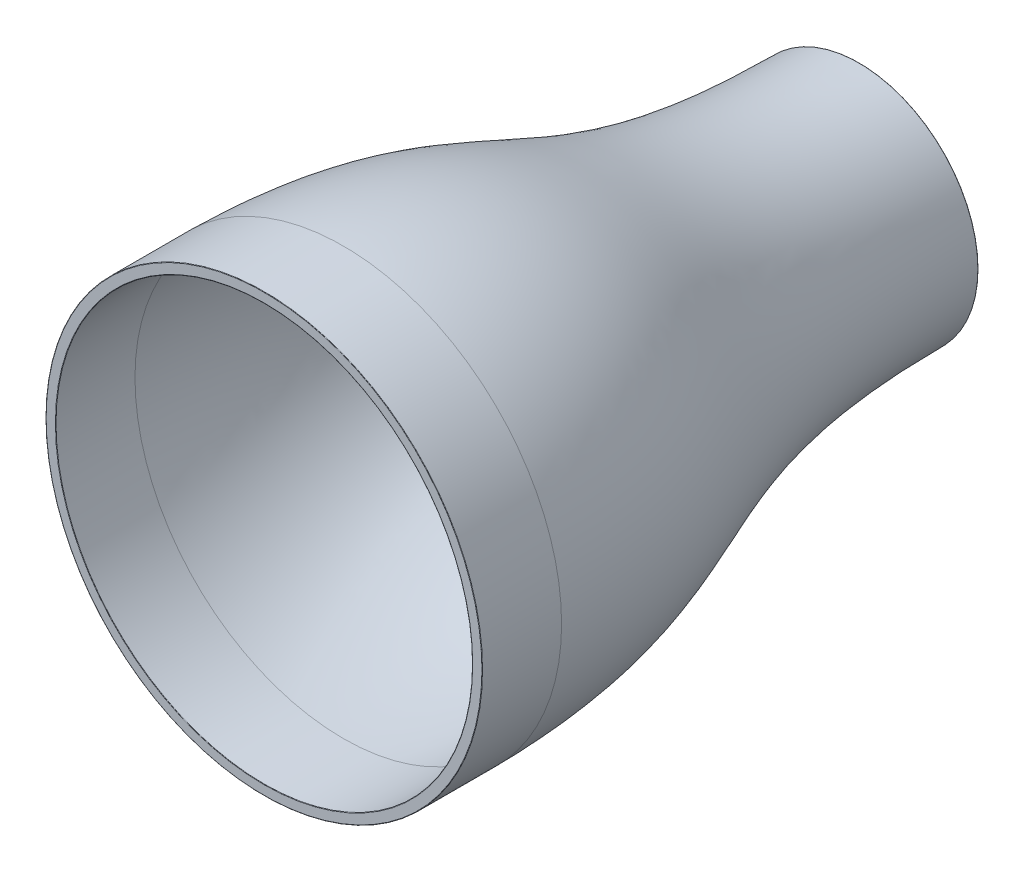
ISO-10303-21;
HEADER;
FILE_DESCRIPTION(('STEP AP214'),'2;1');
FILE_NAME('part.step','',(''),(''),'','','');
FILE_SCHEMA(('AUTOMOTIVE_DESIGN { 1 0 10303 214 1 1 1 1 }'));
ENDSEC;
DATA;
#1=APPLICATION_CONTEXT('core data for automotive mechanical design processes');
#2=APPLICATION_PROTOCOL_DEFINITION('international standard','automotive_design',2000,#1);
#3=PRODUCT_CONTEXT('',#1,'mechanical');
#4=PRODUCT('Part','Part','',(#3));
#5=PRODUCT_RELATED_PRODUCT_CATEGORY('part','',(#4));
#6=PRODUCT_DEFINITION_FORMATION('','',#4);
#7=PRODUCT_DEFINITION_CONTEXT('part definition',#1,'design');
#8=PRODUCT_DEFINITION('design','',#6,#7);
#9=PRODUCT_DEFINITION_SHAPE('','',#8);
#10=(LENGTH_UNIT() NAMED_UNIT(*) SI_UNIT(.MILLI.,.METRE.));
#11=(NAMED_UNIT(*) PLANE_ANGLE_UNIT() SI_UNIT($,.RADIAN.));
#12=(NAMED_UNIT(*) SI_UNIT($,.STERADIAN.) SOLID_ANGLE_UNIT());
#13=UNCERTAINTY_MEASURE_WITH_UNIT(LENGTH_MEASURE(1.E-05),#10,'distance_accuracy_value','');
#14=(GEOMETRIC_REPRESENTATION_CONTEXT(3) GLOBAL_UNCERTAINTY_ASSIGNED_CONTEXT((#13)) GLOBAL_UNIT_ASSIGNED_CONTEXT((#10,
#11,#12)) REPRESENTATION_CONTEXT('',''));
#15=CARTESIAN_POINT('',(0.,0.,0.));
#16=DIRECTION('',(0.,0.,1.));
#17=DIRECTION('',(1.,0.,0.));
#18=AXIS2_PLACEMENT_3D('',#15,#16,#17);
#19=CARTESIAN_POINT('',(0.,105.000572400585,-39.9243450054198));
#20=CARTESIAN_POINT('',(0.,104.985737614351,-40.9046562213823));
#21=CARTESIAN_POINT('',(0.,104.950071243296,-42.8773000139634));
#22=CARTESIAN_POINT('',(0.,104.857338815363,-46.7252645867954));
#23=CARTESIAN_POINT('',(0.,104.700972371027,-51.4222905703763));
#24=CARTESIAN_POINT('',(0.,104.451154587629,-56.8635526672507));
#25=CARTESIAN_POINT('',(0.,104.038009353299,-63.8748037993634));
#26=CARTESIAN_POINT('',(0.,103.37708158559,-72.195159933021));
#27=CARTESIAN_POINT('',(0.,102.370461384114,-81.5249276309053));
#28=CARTESIAN_POINT('',(0.,101.167896472152,-90.2544638520136));
#29=CARTESIAN_POINT('',(0.,99.3262296102299,-101.167419573885));
#30=CARTESIAN_POINT('',(0.,96.6200165044764,-113.586002401627));
#31=CARTESIAN_POINT('',(0.,92.8556752147571,-126.985333475729));
#32=CARTESIAN_POINT('',(0.,88.6957204964014,-139.338719286288));
#33=CARTESIAN_POINT('',(0.,84.257785223071,-151.098628177712));
#34=CARTESIAN_POINT('',(0.,79.6644870089264,-162.706347452458));
#35=CARTESIAN_POINT('',(0.,75.0508323505693,-174.588858931834));
#36=CARTESIAN_POINT('',(0.,70.5652691844925,-187.158880914814));
#37=CARTESIAN_POINT('',(0.,66.3638715469991,-200.81749241288));
#38=CARTESIAN_POINT('',(0.,62.6017423226897,-215.959791253005));
#39=CARTESIAN_POINT('',(0.,59.9562523428313,-230.145053895562));
#40=CARTESIAN_POINT('',(0.,58.2038775868452,-242.635081409947));
#41=CARTESIAN_POINT('',(0.,57.0885892459282,-252.624857821474));
#42=CARTESIAN_POINT('',(0.,56.1891603960676,-263.288718977623));
#43=CARTESIAN_POINT('',(0.,55.6334432269094,-272.780286443282));
#44=CARTESIAN_POINT('',(0.,55.3134825704408,-280.763464410638));
#45=CARTESIAN_POINT('',(0.,55.1379006859554,-286.950915001881));
#46=CARTESIAN_POINT('',(0.,55.0469708048572,-292.284489738278));
#47=CARTESIAN_POINT('',(0.,55.0085109132386,-296.649552564194));
#48=CARTESIAN_POINT('',(0.,55.0008675261206,-298.884988736389));
#49=CARTESIAN_POINT('',(0.,55.0000015186777,-299.996102978673));
#50=B_SPLINE_CURVE_WITH_KNOTS('',3,(#19,#20,#21,#22,#23,#24,#25,#26,#27,#28,#29,#30,#31,#32,#33,
#34,#35,#36,#37,#38,#39,#40,#41,#42,#43,#44,#45,#46,#47,#48,#49),.UNSPECIFIED.,.F.,.F.,(4,1,1,1,
1,1,1,1,1,1,1,1,1,1,1,1,1,1,1,1,1,1,1,1,1,1,1,1,4),(0.,0.0078125,0.015625,0.03125,0.046875,
0.0625,0.09375,0.125,0.15625,0.1875,0.25,0.3125,0.375,0.4375,0.5,0.5625,0.625,0.6875,0.75,
0.8125,0.84375,0.875,0.90625,0.9375,0.953125,0.96875,0.984375,0.9921875,1.),.UNSPECIFIED.);
#51=CARTESIAN_POINT('',(0.,0.,0.));
#52=DIRECTION('',(0.,0.,1.));
#53=AXIS1_PLACEMENT('',#51,#52);
#54=SURFACE_OF_REVOLUTION('',#50,#53);
#55=CARTESIAN_POINT('',(0.,0.,-270.));
#56=DIRECTION('',(0.,0.,1.));
#57=DIRECTION('',(1.,0.,0.));
#58=AXIS2_PLACEMENT_3D('',#55,#56,#57);
#59=CIRCLE('',#58,55.8093728484014);
#60=CARTESIAN_POINT('',(55.8093728484014,0.,-270.));
#61=VERTEX_POINT('',#60);
#62=EDGE_CURVE('E64',#61,#61,#59,.T.);
#63=ORIENTED_EDGE('',*,*,#62,.F.);
#64=EDGE_LOOP('',(#63));
#65=FACE_BOUND('',#64,.T.);
#66=CARTESIAN_POINT('',(0.,0.,-39.9620754887576));
#67=DIRECTION('',(0.,0.,1.));
#68=DIRECTION('',(1.,0.,0.));
#69=AXIS2_PLACEMENT_3D('',#66,#67,#68);
#70=CIRCLE('',#69,105.);
#71=CARTESIAN_POINT('',(105.,0.,-39.9620754887576));
#72=VERTEX_POINT('',#71);
#73=EDGE_CURVE('E70',#72,#72,#70,.T.);
#74=ORIENTED_EDGE('',*,*,#73,.T.);
#75=EDGE_LOOP('',(#74));
#76=FACE_BOUND('',#75,.T.);
#77=ADVANCED_FACE('F32',(#65,#76),#54,.T.);
#78=CARTESIAN_POINT('',(0.,67.4369789211045,-270.));
#79=DIRECTION('',(0.,0.,-1.));
#80=DIRECTION('',(-1.,0.,0.));
#81=AXIS2_PLACEMENT_3D('',#78,#79,#80);
#82=PLANE('',#81);
#83=CARTESIAN_POINT('',(0.,0.,-270.));
#84=DIRECTION('',(0.,0.,-1.));
#85=DIRECTION('',(-1.,0.,0.));
#86=AXIS2_PLACEMENT_3D('',#83,#84,#85);
#87=CIRCLE('',#86,55.);
#88=CARTESIAN_POINT('',(-55.,0.,-270.));
#89=VERTEX_POINT('',#88);
#90=EDGE_CURVE('E73',#89,#89,#87,.T.);
#91=ORIENTED_EDGE('',*,*,#90,.T.);
#92=EDGE_LOOP('',(#91));
#93=FACE_BOUND('',#92,.T.);
#94=ORIENTED_EDGE('',*,*,#62,.T.);
#95=EDGE_LOOP('',(#94));
#96=FACE_BOUND('',#95,.T.);
#97=ADVANCED_FACE('F96',(#93,#96),#82,.F.);
#98=CARTESIAN_POINT('',(0.,67.4369789211045,-300.));
#99=DIRECTION('',(0.,0.,1.));
#100=DIRECTION('',(1.,0.,0.));
#101=AXIS2_PLACEMENT_3D('',#98,#99,#100);
#102=PLANE('',#101);
#103=CARTESIAN_POINT('',(0.,0.,-300.));
#104=DIRECTION('',(0.,0.,1.));
#105=DIRECTION('',(1.,0.,0.));
#106=AXIS2_PLACEMENT_3D('',#103,#104,#105);
#107=CIRCLE('',#106,59.8001873768291);
#108=CARTESIAN_POINT('',(59.8001873768291,0.,-300.));
#109=VERTEX_POINT('',#108);
#110=EDGE_CURVE('E55',#109,#109,#107,.F.);
#111=ORIENTED_EDGE('',*,*,#110,.T.);
#112=EDGE_LOOP('',(#111));
#113=FACE_BOUND('',#112,.T.);
#114=CARTESIAN_POINT('',(0.,0.,-300.));
#115=DIRECTION('',(0.,0.,1.));
#116=DIRECTION('',(1.,0.,0.));
#117=AXIS2_PLACEMENT_3D('',#114,#115,#116);
#118=CIRCLE('',#117,55.2);
#119=CARTESIAN_POINT('',(55.2,0.,-300.));
#120=VERTEX_POINT('',#119);
#121=EDGE_CURVE('E58',#120,#120,#118,.T.);
#122=ORIENTED_EDGE('',*,*,#121,.T.);
#123=EDGE_LOOP('',(#122));
#124=FACE_BOUND('',#123,.T.);
#125=ADVANCED_FACE('F91',(#113,#124),#102,.F.);
#126=CARTESIAN_POINT('',(0.,110.,-40.));
#127=CARTESIAN_POINT('',(0.,108.065881673556,-167.810260187202));
#128=CARTESIAN_POINT('',(0.,60.1108876472334,-157.727730686123));
#129=CARTESIAN_POINT('',(0.,60.,-300.));
#130=B_SPLINE_CURVE_WITH_KNOTS('',3,(#126,#127,#128,#129),.UNSPECIFIED.,.F.,.F.,(4,4),(0.,1.),.UNSPECIFIED.);
#131=CARTESIAN_POINT('',(0.,0.,0.));
#132=DIRECTION('',(0.,0.,1.));
#133=AXIS1_PLACEMENT('',#131,#132);
#134=SURFACE_OF_REVOLUTION('',#130,#133);
#135=CARTESIAN_POINT('',(0.,0.,-299.800219065352));
#136=DIRECTION('',(0.,0.,1.));
#137=DIRECTION('',(1.,0.,0.));
#138=AXIS2_PLACEMENT_3D('',#135,#136,#137);
#139=CIRCLE('',#138,60.000187256855);
#140=CARTESIAN_POINT('',(60.000187256855,0.,-299.800219065352));
#141=VERTEX_POINT('',#140);
#142=EDGE_CURVE('E61',#141,#141,#139,.T.);
#143=ORIENTED_EDGE('',*,*,#142,.T.);
#144=EDGE_LOOP('',(#143));
#145=FACE_BOUND('',#144,.T.);
#146=CARTESIAN_POINT('',(0.,0.,-40.));
#147=DIRECTION('',(0.,0.,1.));
#148=DIRECTION('',(1.,0.,0.));
#149=AXIS2_PLACEMENT_3D('',#146,#147,#148);
#150=CIRCLE('',#149,110.);
#151=CARTESIAN_POINT('',(110.,0.,-40.));
#152=VERTEX_POINT('',#151);
#153=EDGE_CURVE('E67',#152,#152,#150,.T.);
#154=ORIENTED_EDGE('',*,*,#153,.F.);
#155=EDGE_LOOP('',(#154));
#156=FACE_BOUND('',#155,.T.);
#157=ADVANCED_FACE('F86',(#145,#156),#134,.F.);
#158=CARTESIAN_POINT('',(0.,0.,0.));
#159=DIRECTION('',(0.,0.,1.));
#160=DIRECTION('',(1.,0.,0.));
#161=AXIS2_PLACEMENT_3D('',#158,#159,#160);
#162=CYLINDRICAL_SURFACE('',#161,110.);
#163=CARTESIAN_POINT('',(0.,0.,-0.2));
#164=DIRECTION('',(0.,0.,1.));
#165=DIRECTION('',(1.,0.,0.));
#166=AXIS2_PLACEMENT_3D('',#163,#164,#165);
#167=CIRCLE('',#166,110.);
#168=CARTESIAN_POINT('',(110.,0.,-0.2));
#169=VERTEX_POINT('',#168);
#170=EDGE_CURVE('E10',#169,#169,#167,.F.);
#171=ORIENTED_EDGE('',*,*,#170,.T.);
#172=EDGE_LOOP('',(#171));
#173=FACE_BOUND('',#172,.T.);
#174=ORIENTED_EDGE('',*,*,#153,.T.);
#175=EDGE_LOOP('',(#174));
#176=FACE_BOUND('',#175,.T.);
#177=ADVANCED_FACE('F90',(#173,#176),#162,.T.);
#178=CARTESIAN_POINT('',(0.,67.4369789211045,0.));
#179=DIRECTION('',(0.,0.,1.));
#180=DIRECTION('',(1.,0.,0.));
#181=AXIS2_PLACEMENT_3D('',#178,#179,#180);
#182=PLANE('',#181);
#183=CARTESIAN_POINT('',(0.,0.,0.));
#184=DIRECTION('',(0.,0.,1.));
#185=DIRECTION('',(1.,0.,0.));
#186=AXIS2_PLACEMENT_3D('',#183,#184,#185);
#187=CIRCLE('',#186,105.2);
#188=CARTESIAN_POINT('',(105.2,0.,0.));
#189=VERTEX_POINT('',#188);
#190=EDGE_CURVE('E39',#189,#189,#187,.F.);
#191=ORIENTED_EDGE('',*,*,#190,.T.);
#192=EDGE_LOOP('',(#191));
#193=FACE_BOUND('',#192,.T.);
#194=CARTESIAN_POINT('',(0.,0.,0.));
#195=DIRECTION('',(0.,0.,1.));
#196=DIRECTION('',(1.,0.,0.));
#197=AXIS2_PLACEMENT_3D('',#194,#195,#196);
#198=CIRCLE('',#197,109.8);
#199=CARTESIAN_POINT('',(109.8,0.,0.));
#200=VERTEX_POINT('',#199);
#201=EDGE_CURVE('E43',#200,#200,#198,.T.);
#202=ORIENTED_EDGE('',*,*,#201,.T.);
#203=EDGE_LOOP('',(#202));
#204=FACE_BOUND('',#203,.T.);
#205=ADVANCED_FACE('F125',(#193,#204),#182,.T.);
#206=CARTESIAN_POINT('',(0.,0.,0.));
#207=DIRECTION('',(0.,0.,1.));
#208=DIRECTION('',(1.,0.,0.));
#209=AXIS2_PLACEMENT_3D('',#206,#207,#208);
#210=CYLINDRICAL_SURFACE('',#209,105.);
#211=CARTESIAN_POINT('',(0.,0.,-0.2));
#212=DIRECTION('',(0.,0.,1.));
#213=DIRECTION('',(1.,0.,0.));
#214=AXIS2_PLACEMENT_3D('',#211,#212,#213);
#215=CIRCLE('',#214,105.);
#216=CARTESIAN_POINT('',(105.,0.,-0.2));
#217=VERTEX_POINT('',#216);
#218=EDGE_CURVE('E47',#217,#217,#215,.T.);
#219=ORIENTED_EDGE('',*,*,#218,.T.);
#220=EDGE_LOOP('',(#219));
#221=FACE_BOUND('',#220,.T.);
#222=ORIENTED_EDGE('',*,*,#73,.F.);
#223=EDGE_LOOP('',(#222));
#224=FACE_BOUND('',#223,.T.);
#225=ADVANCED_FACE('F122',(#221,#224),#210,.F.);
#226=CARTESIAN_POINT('',(0.,0.,0.));
#227=DIRECTION('',(0.,0.,-1.));
#228=DIRECTION('',(-1.,0.,0.));
#229=AXIS2_PLACEMENT_3D('',#226,#227,#228);
#230=CYLINDRICAL_SURFACE('',#229,55.);
#231=CARTESIAN_POINT('',(0.,0.,-299.8));
#232=DIRECTION('',(0.,0.,1.));
#233=DIRECTION('',(1.,0.,0.));
#234=AXIS2_PLACEMENT_3D('',#231,#232,#233);
#235=CIRCLE('',#234,55.);
#236=CARTESIAN_POINT('',(55.,0.,-299.8));
#237=VERTEX_POINT('',#236);
#238=EDGE_CURVE('E52',#237,#237,#235,.F.);
#239=ORIENTED_EDGE('',*,*,#238,.T.);
#240=EDGE_LOOP('',(#239));
#241=FACE_BOUND('',#240,.T.);
#242=ORIENTED_EDGE('',*,*,#90,.F.);
#243=EDGE_LOOP('',(#242));
#244=FACE_BOUND('',#243,.T.);
#245=ADVANCED_FACE('F108',(#241,#244),#230,.F.);
#246=CARTESIAN_POINT('',(0.,0.,-299.8));
#247=DIRECTION('',(0.,0.,1.));
#248=DIRECTION('',(1.,0.,0.));
#249=AXIS2_PLACEMENT_3D('',#246,#247,#248);
#250=TOROIDAL_SURFACE('',#249,59.8001873768291,0.2);
#251=ORIENTED_EDGE('',*,*,#110,.F.);
#252=EDGE_LOOP('',(#251));
#253=FACE_BOUND('',#252,.T.);
#254=ORIENTED_EDGE('',*,*,#142,.F.);
#255=EDGE_LOOP('',(#254));
#256=FACE_BOUND('',#255,.T.);
#257=ADVANCED_FACE('F104',(#253,#256),#250,.T.);
#258=CARTESIAN_POINT('',(0.,0.,-299.8));
#259=DIRECTION('',(0.,0.,1.));
#260=DIRECTION('',(1.,0.,0.));
#261=AXIS2_PLACEMENT_3D('',#258,#259,#260);
#262=TOROIDAL_SURFACE('',#261,55.2,0.2);
#263=ORIENTED_EDGE('',*,*,#121,.F.);
#264=EDGE_LOOP('',(#263));
#265=FACE_BOUND('',#264,.T.);
#266=ORIENTED_EDGE('',*,*,#238,.F.);
#267=EDGE_LOOP('',(#266));
#268=FACE_BOUND('',#267,.T.);
#269=ADVANCED_FACE('F107',(#265,#268),#262,.T.);
#270=CARTESIAN_POINT('',(0.,0.,-0.2));
#271=DIRECTION('',(0.,0.,1.));
#272=DIRECTION('',(1.,0.,0.));
#273=AXIS2_PLACEMENT_3D('',#270,#271,#272);
#274=TOROIDAL_SURFACE('',#273,105.2,0.2);
#275=ORIENTED_EDGE('',*,*,#190,.F.);
#276=EDGE_LOOP('',(#275));
#277=FACE_BOUND('',#276,.T.);
#278=ORIENTED_EDGE('',*,*,#218,.F.);
#279=EDGE_LOOP('',(#278));
#280=FACE_BOUND('',#279,.T.);
#281=ADVANCED_FACE('F111',(#277,#280),#274,.T.);
#282=CARTESIAN_POINT('',(0.,0.,-0.2));
#283=DIRECTION('',(0.,0.,1.));
#284=DIRECTION('',(1.,0.,0.));
#285=AXIS2_PLACEMENT_3D('',#282,#283,#284);
#286=TOROIDAL_SURFACE('',#285,109.8,0.2);
#287=ORIENTED_EDGE('',*,*,#170,.F.);
#288=EDGE_LOOP('',(#287));
#289=FACE_BOUND('',#288,.T.);
#290=ORIENTED_EDGE('',*,*,#201,.F.);
#291=EDGE_LOOP('',(#290));
#292=FACE_BOUND('',#291,.T.);
#293=ADVANCED_FACE('F34',(#289,#292),#286,.T.);
#294=CLOSED_SHELL('',(#77,#97,#125,#157,#177,#205,#225,#245,#257,#269,#281,#293));
#295=MANIFOLD_SOLID_BREP('B2',#294);
#296=ADVANCED_BREP_SHAPE_REPRESENTATION('',(#18,#295),#14);
#297=SHAPE_DEFINITION_REPRESENTATION(#9,#296);
ENDSEC;
END-ISO-10303-21;
